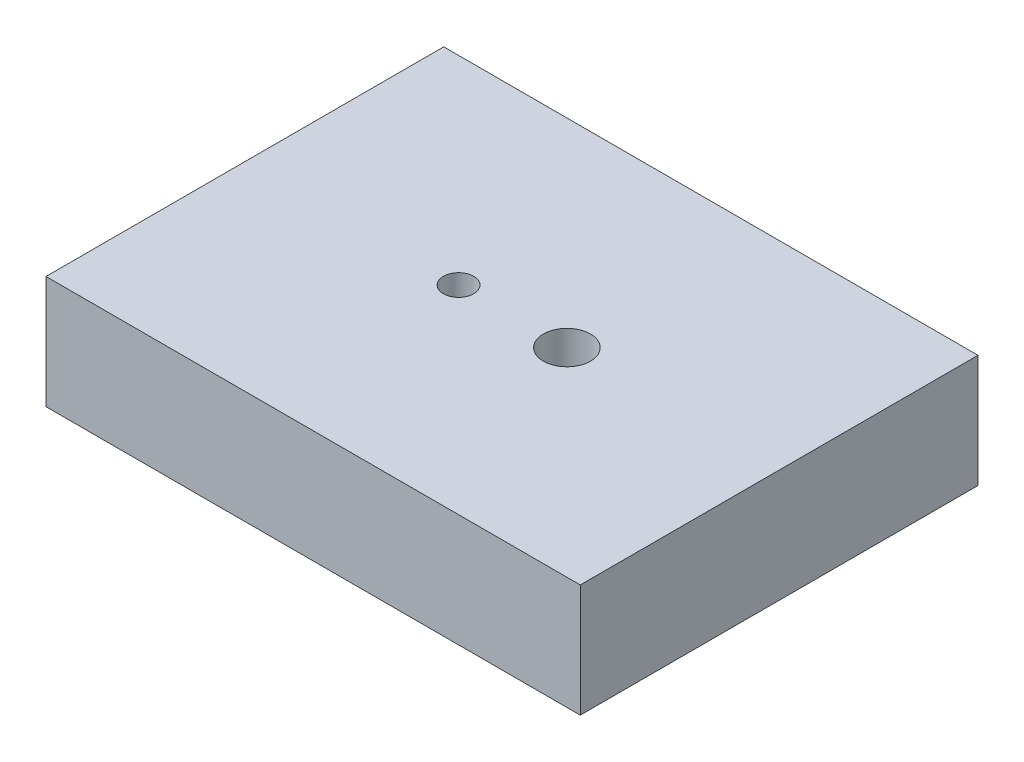
ISO-10303-21;
HEADER;
FILE_DESCRIPTION(('STEP AP214'),'2;1');
FILE_NAME('part.step','',(''),(''),'','','');
FILE_SCHEMA(('AUTOMOTIVE_DESIGN { 1 0 10303 214 1 1 1 1 }'));
ENDSEC;
DATA;
#1=APPLICATION_CONTEXT('core data for automotive mechanical design processes');
#2=APPLICATION_PROTOCOL_DEFINITION('international standard','automotive_design',2000,#1);
#3=PRODUCT_CONTEXT('',#1,'mechanical');
#4=PRODUCT('Part','Part','',(#3));
#5=PRODUCT_RELATED_PRODUCT_CATEGORY('part','',(#4));
#6=PRODUCT_DEFINITION_FORMATION('','',#4);
#7=PRODUCT_DEFINITION_CONTEXT('part definition',#1,'design');
#8=PRODUCT_DEFINITION('design','',#6,#7);
#9=PRODUCT_DEFINITION_SHAPE('','',#8);
#10=(LENGTH_UNIT() NAMED_UNIT(*) SI_UNIT(.MILLI.,.METRE.));
#11=(NAMED_UNIT(*) PLANE_ANGLE_UNIT() SI_UNIT($,.RADIAN.));
#12=(NAMED_UNIT(*) SI_UNIT($,.STERADIAN.) SOLID_ANGLE_UNIT());
#13=UNCERTAINTY_MEASURE_WITH_UNIT(LENGTH_MEASURE(1.E-05),#10,'distance_accuracy_value','');
#14=(GEOMETRIC_REPRESENTATION_CONTEXT(3) GLOBAL_UNCERTAINTY_ASSIGNED_CONTEXT((#13)) GLOBAL_UNIT_ASSIGNED_CONTEXT((#10,
#11,#12)) REPRESENTATION_CONTEXT('',''));
#15=CARTESIAN_POINT('',(0.,0.,0.));
#16=DIRECTION('',(0.,0.,1.));
#17=DIRECTION('',(1.,0.,0.));
#18=AXIS2_PLACEMENT_3D('',#15,#16,#17);
#19=CARTESIAN_POINT('',(0.,19.,0.));
#20=DIRECTION('',(1.,0.,0.));
#21=DIRECTION('',(0.,0.,-1.));
#22=AXIS2_PLACEMENT_3D('',#19,#20,#21);
#23=PLANE('',#22);
#24=DIRECTION('',(0.,0.,1.));
#25=VECTOR('',#24,1.);
#26=CARTESIAN_POINT('',(0.,0.,0.));
#27=LINE('',#26,#25);
#28=CARTESIAN_POINT('',(0.,0.,0.));
#29=VERTEX_POINT('',#28);
#30=CARTESIAN_POINT('',(0.,0.,67.));
#31=VERTEX_POINT('',#30);
#32=EDGE_CURVE('E97',#29,#31,#27,.T.);
#33=ORIENTED_EDGE('',*,*,#32,.T.);
#34=DIRECTION('',(0.,-1.,0.));
#35=VECTOR('',#34,1.);
#36=CARTESIAN_POINT('',(0.,19.,67.));
#37=LINE('',#36,#35);
#38=CARTESIAN_POINT('',(0.,19.,67.));
#39=VERTEX_POINT('',#38);
#40=EDGE_CURVE('E11',#39,#31,#37,.T.);
#41=ORIENTED_EDGE('',*,*,#40,.F.);
#42=DIRECTION('',(0.,0.,1.));
#43=VECTOR('',#42,1.);
#44=CARTESIAN_POINT('',(0.,19.,0.));
#45=LINE('',#44,#43);
#46=CARTESIAN_POINT('',(0.,19.,0.));
#47=VERTEX_POINT('',#46);
#48=EDGE_CURVE('E85',#47,#39,#45,.T.);
#49=ORIENTED_EDGE('',*,*,#48,.F.);
#50=DIRECTION('',(0.,-1.,0.));
#51=VECTOR('',#50,1.);
#52=CARTESIAN_POINT('',(0.,19.,0.));
#53=LINE('',#52,#51);
#54=EDGE_CURVE('E93',#47,#29,#53,.T.);
#55=ORIENTED_EDGE('',*,*,#54,.T.);
#56=EDGE_LOOP('',(#33,#41,#49,#55));
#57=FACE_BOUND('',#56,.T.);
#58=ADVANCED_FACE('F34',(#57),#23,.F.);
#59=CARTESIAN_POINT('',(0.,19.,67.));
#60=DIRECTION('',(0.,0.,-1.));
#61=DIRECTION('',(-1.,0.,0.));
#62=AXIS2_PLACEMENT_3D('',#59,#60,#61);
#63=PLANE('',#62);
#64=DIRECTION('',(1.,0.,0.));
#65=VECTOR('',#64,1.);
#66=CARTESIAN_POINT('',(0.,0.,67.));
#67=LINE('',#66,#65);
#68=CARTESIAN_POINT('',(90.,0.,67.));
#69=VERTEX_POINT('',#68);
#70=EDGE_CURVE('E89',#31,#69,#67,.T.);
#71=ORIENTED_EDGE('',*,*,#70,.T.);
#72=DIRECTION('',(0.,-1.,0.));
#73=VECTOR('',#72,1.);
#74=CARTESIAN_POINT('',(90.,19.,67.));
#75=LINE('',#74,#73);
#76=CARTESIAN_POINT('',(90.,19.,67.));
#77=VERTEX_POINT('',#76);
#78=EDGE_CURVE('E42',#77,#69,#75,.T.);
#79=ORIENTED_EDGE('',*,*,#78,.F.);
#80=DIRECTION('',(1.,0.,0.));
#81=VECTOR('',#80,1.);
#82=CARTESIAN_POINT('',(0.,19.,67.));
#83=LINE('',#82,#81);
#84=EDGE_CURVE('E80',#39,#77,#83,.T.);
#85=ORIENTED_EDGE('',*,*,#84,.F.);
#86=ORIENTED_EDGE('',*,*,#40,.T.);
#87=EDGE_LOOP('',(#71,#79,#85,#86));
#88=FACE_BOUND('',#87,.T.);
#89=ADVANCED_FACE('F88',(#88),#63,.F.);
#90=CARTESIAN_POINT('',(90.,19.,0.));
#91=DIRECTION('',(-1.,0.,0.));
#92=DIRECTION('',(0.,0.,1.));
#93=AXIS2_PLACEMENT_3D('',#90,#91,#92);
#94=PLANE('',#93);
#95=DIRECTION('',(0.,0.,-1.));
#96=VECTOR('',#95,1.);
#97=CARTESIAN_POINT('',(90.,0.,0.));
#98=LINE('',#97,#96);
#99=CARTESIAN_POINT('',(90.,0.,0.));
#100=VERTEX_POINT('',#99);
#101=EDGE_CURVE('E67',#69,#100,#98,.T.);
#102=ORIENTED_EDGE('',*,*,#101,.T.);
#103=DIRECTION('',(0.,-1.,0.));
#104=VECTOR('',#103,1.);
#105=CARTESIAN_POINT('',(90.,19.,0.));
#106=LINE('',#105,#104);
#107=CARTESIAN_POINT('',(90.,19.,0.));
#108=VERTEX_POINT('',#107);
#109=EDGE_CURVE('E90',#108,#100,#106,.T.);
#110=ORIENTED_EDGE('',*,*,#109,.F.);
#111=DIRECTION('',(0.,0.,-1.));
#112=VECTOR('',#111,1.);
#113=CARTESIAN_POINT('',(90.,19.,0.));
#114=LINE('',#113,#112);
#115=EDGE_CURVE('E83',#77,#108,#114,.T.);
#116=ORIENTED_EDGE('',*,*,#115,.F.);
#117=ORIENTED_EDGE('',*,*,#78,.T.);
#118=EDGE_LOOP('',(#102,#110,#116,#117));
#119=FACE_BOUND('',#118,.T.);
#120=ADVANCED_FACE('F91',(#119),#94,.F.);
#121=CARTESIAN_POINT('',(0.,19.,0.));
#122=DIRECTION('',(0.,0.,1.));
#123=DIRECTION('',(1.,0.,0.));
#124=AXIS2_PLACEMENT_3D('',#121,#122,#123);
#125=PLANE('',#124);
#126=DIRECTION('',(-1.,0.,0.));
#127=VECTOR('',#126,1.);
#128=CARTESIAN_POINT('',(0.,0.,0.));
#129=LINE('',#128,#127);
#130=EDGE_CURVE('E73',#100,#29,#129,.T.);
#131=ORIENTED_EDGE('',*,*,#130,.T.);
#132=ORIENTED_EDGE('',*,*,#54,.F.);
#133=DIRECTION('',(-1.,0.,0.));
#134=VECTOR('',#133,1.);
#135=CARTESIAN_POINT('',(0.,19.,0.));
#136=LINE('',#135,#134);
#137=EDGE_CURVE('E50',#108,#47,#136,.T.);
#138=ORIENTED_EDGE('',*,*,#137,.F.);
#139=ORIENTED_EDGE('',*,*,#109,.T.);
#140=EDGE_LOOP('',(#131,#132,#138,#139));
#141=FACE_BOUND('',#140,.T.);
#142=ADVANCED_FACE('F105',(#141),#125,.F.);
#143=CARTESIAN_POINT('',(0.,19.,0.));
#144=DIRECTION('',(0.,1.,0.));
#145=DIRECTION('',(0.,0.,1.));
#146=AXIS2_PLACEMENT_3D('',#143,#144,#145);
#147=PLANE('',#146);
#148=CARTESIAN_POINT('',(54.25,19.,33.5));
#149=DIRECTION('',(0.,-1.,0.));
#150=DIRECTION('',(0.,0.,-1.));
#151=AXIS2_PLACEMENT_3D('',#148,#149,#150);
#152=CIRCLE('',#151,3.96874999999999);
#153=CARTESIAN_POINT('',(54.25,19.,29.53125));
#154=VERTEX_POINT('',#153);
#155=EDGE_CURVE('E116',#154,#154,#152,.T.);
#156=ORIENTED_EDGE('',*,*,#155,.T.);
#157=EDGE_LOOP('',(#156));
#158=FACE_BOUND('',#157,.T.);
#159=CARTESIAN_POINT('',(36.,19.,33.5));
#160=DIRECTION('',(0.,-1.,0.));
#161=DIRECTION('',(0.,0.,-1.));
#162=AXIS2_PLACEMENT_3D('',#159,#160,#161);
#163=CIRCLE('',#162,2.5527);
#164=CARTESIAN_POINT('',(36.,19.,30.9473));
#165=VERTEX_POINT('',#164);
#166=EDGE_CURVE('E100',#165,#165,#163,.T.);
#167=ORIENTED_EDGE('',*,*,#166,.T.);
#168=EDGE_LOOP('',(#167));
#169=FACE_BOUND('',#168,.T.);
#170=ORIENTED_EDGE('',*,*,#48,.T.);
#171=ORIENTED_EDGE('',*,*,#84,.T.);
#172=ORIENTED_EDGE('',*,*,#115,.T.);
#173=ORIENTED_EDGE('',*,*,#137,.T.);
#174=EDGE_LOOP('',(#170,#171,#172,#173));
#175=FACE_BOUND('',#174,.T.);
#176=ADVANCED_FACE('F81',(#158,#169,#175),#147,.T.);
#177=CARTESIAN_POINT('',(0.,0.,0.));
#178=DIRECTION('',(0.,1.,0.));
#179=DIRECTION('',(0.,0.,1.));
#180=AXIS2_PLACEMENT_3D('',#177,#178,#179);
#181=PLANE('',#180);
#182=CARTESIAN_POINT('',(54.25,0.,33.5));
#183=DIRECTION('',(0.,-1.,0.));
#184=DIRECTION('',(0.,0.,-1.));
#185=AXIS2_PLACEMENT_3D('',#182,#183,#184);
#186=CIRCLE('',#185,3.96874999999999);
#187=CARTESIAN_POINT('',(54.25,0.,29.53125));
#188=VERTEX_POINT('',#187);
#189=EDGE_CURVE('E119',#188,#188,#186,.T.);
#190=ORIENTED_EDGE('',*,*,#189,.F.);
#191=EDGE_LOOP('',(#190));
#192=FACE_BOUND('',#191,.T.);
#193=CARTESIAN_POINT('',(36.,0.,33.5));
#194=DIRECTION('',(0.,-1.,0.));
#195=DIRECTION('',(0.,0.,-1.));
#196=AXIS2_PLACEMENT_3D('',#193,#194,#195);
#197=CIRCLE('',#196,2.55269999999999);
#198=CARTESIAN_POINT('',(36.,0.,30.9473));
#199=VERTEX_POINT('',#198);
#200=EDGE_CURVE('E113',#199,#199,#197,.T.);
#201=ORIENTED_EDGE('',*,*,#200,.F.);
#202=EDGE_LOOP('',(#201));
#203=FACE_BOUND('',#202,.T.);
#204=ORIENTED_EDGE('',*,*,#32,.F.);
#205=ORIENTED_EDGE('',*,*,#130,.F.);
#206=ORIENTED_EDGE('',*,*,#101,.F.);
#207=ORIENTED_EDGE('',*,*,#70,.F.);
#208=EDGE_LOOP('',(#204,#205,#206,#207));
#209=FACE_BOUND('',#208,.T.);
#210=ADVANCED_FACE('F108',(#192,#203,#209),#181,.F.);
#211=CARTESIAN_POINT('',(36.,0.,33.5));
#212=DIRECTION('',(0.,-1.,0.));
#213=DIRECTION('',(0.,0.,-1.));
#214=AXIS2_PLACEMENT_3D('',#211,#212,#213);
#215=CYLINDRICAL_SURFACE('',#214,2.55269999999999);
#216=ORIENTED_EDGE('',*,*,#166,.F.);
#217=EDGE_LOOP('',(#216));
#218=FACE_BOUND('',#217,.T.);
#219=ORIENTED_EDGE('',*,*,#200,.T.);
#220=EDGE_LOOP('',(#219));
#221=FACE_BOUND('',#220,.T.);
#222=ADVANCED_FACE('F127',(#218,#221),#215,.F.);
#223=CARTESIAN_POINT('',(54.25,0.,33.5));
#224=DIRECTION('',(0.,-1.,0.));
#225=DIRECTION('',(0.,0.,-1.));
#226=AXIS2_PLACEMENT_3D('',#223,#224,#225);
#227=CYLINDRICAL_SURFACE('',#226,3.96874999999999);
#228=ORIENTED_EDGE('',*,*,#155,.F.);
#229=EDGE_LOOP('',(#228));
#230=FACE_BOUND('',#229,.T.);
#231=ORIENTED_EDGE('',*,*,#189,.T.);
#232=EDGE_LOOP('',(#231));
#233=FACE_BOUND('',#232,.T.);
#234=ADVANCED_FACE('F123',(#230,#233),#227,.F.);
#235=CLOSED_SHELL('',(#58,#89,#120,#142,#176,#210,#222,#234));
#236=MANIFOLD_SOLID_BREP('B2',#235);
#237=ADVANCED_BREP_SHAPE_REPRESENTATION('',(#18,#236),#14);
#238=SHAPE_DEFINITION_REPRESENTATION(#9,#237);
ENDSEC;
END-ISO-10303-21;
